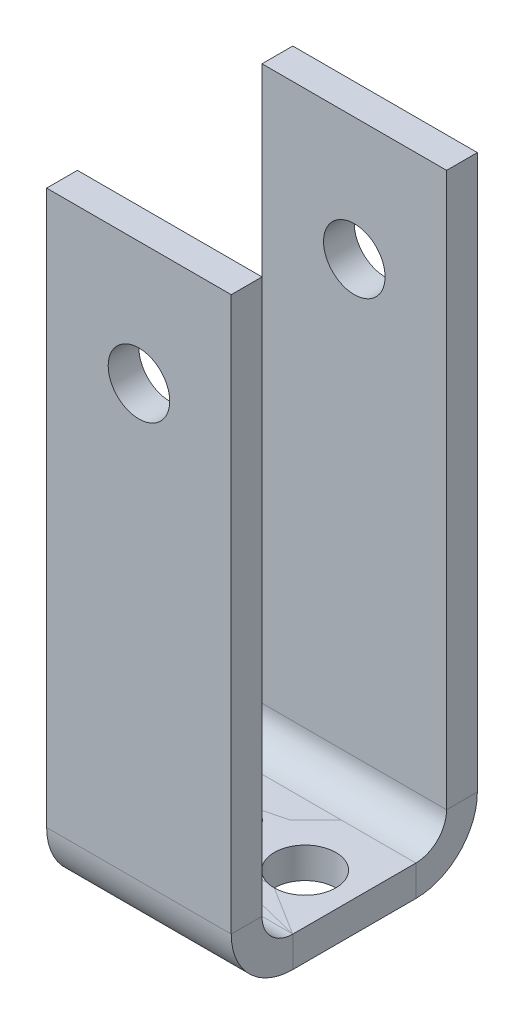
ISO-10303-21;
HEADER;
FILE_DESCRIPTION(('STEP AP214'),'2;1');
FILE_NAME('part.step','',(''),(''),'','','');
FILE_SCHEMA(('AUTOMOTIVE_DESIGN { 1 0 10303 214 1 1 1 1 }'));
ENDSEC;
DATA;
#1=APPLICATION_CONTEXT('core data for automotive mechanical design processes');
#2=APPLICATION_PROTOCOL_DEFINITION('international standard','automotive_design',2000,#1);
#3=PRODUCT_CONTEXT('',#1,'mechanical');
#4=PRODUCT('Part','Part','',(#3));
#5=PRODUCT_RELATED_PRODUCT_CATEGORY('part','',(#4));
#6=PRODUCT_DEFINITION_FORMATION('','',#4);
#7=PRODUCT_DEFINITION_CONTEXT('part definition',#1,'design');
#8=PRODUCT_DEFINITION('design','',#6,#7);
#9=PRODUCT_DEFINITION_SHAPE('','',#8);
#10=(LENGTH_UNIT() NAMED_UNIT(*) SI_UNIT(.MILLI.,.METRE.));
#11=(NAMED_UNIT(*) PLANE_ANGLE_UNIT() SI_UNIT($,.RADIAN.));
#12=(NAMED_UNIT(*) SI_UNIT($,.STERADIAN.) SOLID_ANGLE_UNIT());
#13=UNCERTAINTY_MEASURE_WITH_UNIT(LENGTH_MEASURE(1.E-05),#10,'distance_accuracy_value','');
#14=(GEOMETRIC_REPRESENTATION_CONTEXT(3) GLOBAL_UNCERTAINTY_ASSIGNED_CONTEXT((#13)) GLOBAL_UNIT_ASSIGNED_CONTEXT((#10,
#11,#12)) REPRESENTATION_CONTEXT('',''));
#15=CARTESIAN_POINT('',(0.,0.,0.));
#16=DIRECTION('',(0.,0.,1.));
#17=DIRECTION('',(1.,0.,0.));
#18=AXIS2_PLACEMENT_3D('',#15,#16,#17);
#19=CARTESIAN_POINT('',(19.05,3.175,0.));
#20=DIRECTION('',(-1.,0.,0.));
#21=DIRECTION('',(0.,0.,-1.));
#22=AXIS2_PLACEMENT_3D('',#19,#20,#21);
#23=PLANE('',#22);
#24=DIRECTION('',(0.,1.,0.));
#25=VECTOR('',#24,1.);
#26=CARTESIAN_POINT('',(19.05,3.175,0.));
#27=LINE('',#26,#25);
#28=CARTESIAN_POINT('',(19.05,0.,0.));
#29=VERTEX_POINT('',#28);
#30=CARTESIAN_POINT('',(19.05,3.175,0.));
#31=VERTEX_POINT('',#30);
#32=EDGE_CURVE('E14',#29,#31,#27,.T.);
#33=ORIENTED_EDGE('',*,*,#32,.F.);
#34=DIRECTION('',(0.,0.,-1.));
#35=VECTOR('',#34,1.);
#36=CARTESIAN_POINT('',(19.05,0.,0.));
#37=LINE('',#36,#35);
#38=CARTESIAN_POINT('',(19.05,0.,-12.7));
#39=VERTEX_POINT('',#38);
#40=EDGE_CURVE('E385',#29,#39,#37,.T.);
#41=ORIENTED_EDGE('',*,*,#40,.T.);
#42=DIRECTION('',(0.,1.,0.));
#43=VECTOR('',#42,1.);
#44=CARTESIAN_POINT('',(19.05,3.175,-12.7));
#45=LINE('',#44,#43);
#46=CARTESIAN_POINT('',(19.05,3.175,-12.7));
#47=VERTEX_POINT('',#46);
#48=EDGE_CURVE('E130',#39,#47,#45,.T.);
#49=ORIENTED_EDGE('',*,*,#48,.T.);
#50=DIRECTION('',(0.,0.,-1.));
#51=VECTOR('',#50,1.);
#52=CARTESIAN_POINT('',(19.05,3.175,0.));
#53=LINE('',#52,#51);
#54=EDGE_CURVE('E376',#31,#47,#53,.T.);
#55=ORIENTED_EDGE('',*,*,#54,.F.);
#56=EDGE_LOOP('',(#33,#41,#49,#55));
#57=FACE_BOUND('',#56,.T.);
#58=ADVANCED_FACE('F121',(#57),#23,.F.);
#59=CARTESIAN_POINT('',(0.,3.175,0.));
#60=DIRECTION('',(0.,-1.,0.));
#61=DIRECTION('',(0.,0.,-1.));
#62=AXIS2_PLACEMENT_3D('',#59,#60,#61);
#63=PLANE('',#62);
#64=CARTESIAN_POINT('',(5.08,3.175,-6.35));
#65=DIRECTION('',(0.,1.,0.));
#66=DIRECTION('',(0.,0.,1.));
#67=AXIS2_PLACEMENT_3D('',#64,#65,#66);
#68=CIRCLE('',#67,3.175);
#69=CARTESIAN_POINT('',(5.08,3.175,-3.175));
#70=VERTEX_POINT('',#69);
#71=EDGE_CURVE('E411',#70,#70,#68,.T.);
#72=ORIENTED_EDGE('',*,*,#71,.F.);
#73=EDGE_LOOP('',(#72));
#74=FACE_BOUND('',#73,.T.);
#75=CARTESIAN_POINT('',(13.97,3.175,-6.35));
#76=DIRECTION('',(0.,1.,0.));
#77=DIRECTION('',(0.,0.,1.));
#78=AXIS2_PLACEMENT_3D('',#75,#76,#77);
#79=CIRCLE('',#78,3.175);
#80=CARTESIAN_POINT('',(13.97,3.175,-3.175));
#81=VERTEX_POINT('',#80);
#82=EDGE_CURVE('E401',#81,#81,#79,.T.);
#83=ORIENTED_EDGE('',*,*,#82,.F.);
#84=EDGE_LOOP('',(#83));
#85=FACE_BOUND('',#84,.T.);
#86=DIRECTION('',(0.,0.,1.));
#87=VECTOR('',#86,1.);
#88=CARTESIAN_POINT('',(0.,3.175,0.));
#89=LINE('',#88,#87);
#90=CARTESIAN_POINT('',(0.,3.175,-12.7));
#91=VERTEX_POINT('',#90);
#92=CARTESIAN_POINT('',(0.,3.175,0.));
#93=VERTEX_POINT('',#92);
#94=EDGE_CURVE('E371',#91,#93,#89,.T.);
#95=ORIENTED_EDGE('',*,*,#94,.T.);
#96=DIRECTION('',(1.,0.,0.));
#97=VECTOR('',#96,1.);
#98=CARTESIAN_POINT('',(0.,3.175,0.));
#99=LINE('',#98,#97);
#100=EDGE_CURVE('E373',#93,#31,#99,.T.);
#101=ORIENTED_EDGE('',*,*,#100,.T.);
#102=ORIENTED_EDGE('',*,*,#54,.T.);
#103=DIRECTION('',(-1.,0.,0.));
#104=VECTOR('',#103,1.);
#105=CARTESIAN_POINT('',(0.,3.175,-12.7));
#106=LINE('',#105,#104);
#107=EDGE_CURVE('E138',#47,#91,#106,.T.);
#108=ORIENTED_EDGE('',*,*,#107,.T.);
#109=EDGE_LOOP('',(#95,#101,#102,#108));
#110=FACE_BOUND('',#109,.T.);
#111=ADVANCED_FACE('F445',(#74,#85,#110),#63,.F.);
#112=CARTESIAN_POINT('',(0.,0.,0.));
#113=DIRECTION('',(0.,-1.,0.));
#114=DIRECTION('',(0.,0.,-1.));
#115=AXIS2_PLACEMENT_3D('',#112,#113,#114);
#116=PLANE('',#115);
#117=CARTESIAN_POINT('',(5.08,0.,-6.35));
#118=DIRECTION('',(0.,-1.,0.));
#119=DIRECTION('',(0.,0.,-1.));
#120=AXIS2_PLACEMENT_3D('',#117,#118,#119);
#121=CIRCLE('',#120,3.175);
#122=CARTESIAN_POINT('',(5.08,0.,-9.525));
#123=VERTEX_POINT('',#122);
#124=EDGE_CURVE('E124',#123,#123,#121,.T.);
#125=ORIENTED_EDGE('',*,*,#124,.F.);
#126=EDGE_LOOP('',(#125));
#127=FACE_BOUND('',#126,.T.);
#128=CARTESIAN_POINT('',(13.97,0.,-6.35));
#129=DIRECTION('',(0.,-1.,0.));
#130=DIRECTION('',(0.,0.,-1.));
#131=AXIS2_PLACEMENT_3D('',#128,#129,#130);
#132=CIRCLE('',#131,3.175);
#133=CARTESIAN_POINT('',(13.97,0.,-9.525));
#134=VERTEX_POINT('',#133);
#135=EDGE_CURVE('E399',#134,#134,#132,.T.);
#136=ORIENTED_EDGE('',*,*,#135,.F.);
#137=EDGE_LOOP('',(#136));
#138=FACE_BOUND('',#137,.T.);
#139=DIRECTION('',(0.,0.,-1.));
#140=VECTOR('',#139,1.);
#141=CARTESIAN_POINT('',(0.,0.,0.));
#142=LINE('',#141,#140);
#143=CARTESIAN_POINT('',(0.,0.,-12.7));
#144=VERTEX_POINT('',#143);
#145=CARTESIAN_POINT('',(0.,0.,0.));
#146=VERTEX_POINT('',#145);
#147=EDGE_CURVE('E362',#144,#146,#142,.F.);
#148=ORIENTED_EDGE('',*,*,#147,.F.);
#149=DIRECTION('',(1.,0.,0.));
#150=VECTOR('',#149,1.);
#151=CARTESIAN_POINT('',(0.,0.,-12.7));
#152=LINE('',#151,#150);
#153=EDGE_CURVE('E374',#39,#144,#152,.F.);
#154=ORIENTED_EDGE('',*,*,#153,.F.);
#155=ORIENTED_EDGE('',*,*,#40,.F.);
#156=DIRECTION('',(1.,0.,0.));
#157=VECTOR('',#156,1.);
#158=CARTESIAN_POINT('',(0.,0.,0.));
#159=LINE('',#158,#157);
#160=EDGE_CURVE('E382',#146,#29,#159,.T.);
#161=ORIENTED_EDGE('',*,*,#160,.F.);
#162=EDGE_LOOP('',(#148,#154,#155,#161));
#163=FACE_BOUND('',#162,.T.);
#164=ADVANCED_FACE('F451',(#127,#138,#163),#116,.T.);
#165=CARTESIAN_POINT('',(19.05,6.34999999999997,-12.7));
#166=DIRECTION('',(1.,0.,0.));
#167=DIRECTION('',(0.,1.,0.));
#168=AXIS2_PLACEMENT_3D('',#165,#166,#167);
#169=PLANE('',#168);
#170=DIRECTION('',(0.,0.,1.));
#171=VECTOR('',#170,1.);
#172=CARTESIAN_POINT('',(19.05,6.35000000000001,-19.05));
#173=LINE('',#172,#171);
#174=CARTESIAN_POINT('',(19.05,6.34999999999996,-15.875));
#175=VERTEX_POINT('',#174);
#176=CARTESIAN_POINT('',(19.05,6.34999999999995,-19.05));
#177=VERTEX_POINT('',#176);
#178=EDGE_CURVE('E320',#175,#177,#173,.F.);
#179=ORIENTED_EDGE('',*,*,#178,.F.);
#180=CARTESIAN_POINT('',(19.05,6.34999999999997,-12.7));
#181=DIRECTION('',(-1.,0.,0.));
#182=DIRECTION('',(0.,-1.,0.));
#183=AXIS2_PLACEMENT_3D('',#180,#181,#182);
#184=CIRCLE('',#183,3.175);
#185=EDGE_CURVE('E366',#47,#175,#184,.F.);
#186=ORIENTED_EDGE('',*,*,#185,.F.);
#187=ORIENTED_EDGE('',*,*,#48,.F.);
#188=CARTESIAN_POINT('',(19.05,6.34999999999997,-12.7));
#189=DIRECTION('',(-1.,0.,0.));
#190=DIRECTION('',(0.,-1.,0.));
#191=AXIS2_PLACEMENT_3D('',#188,#189,#190);
#192=CIRCLE('',#191,6.35);
#193=EDGE_CURVE('E359',#39,#177,#192,.F.);
#194=ORIENTED_EDGE('',*,*,#193,.T.);
#195=EDGE_LOOP('',(#179,#186,#187,#194));
#196=FACE_BOUND('',#195,.T.);
#197=ADVANCED_FACE('F547',(#196),#169,.T.);
#198=CARTESIAN_POINT('',(0.,6.34999999999997,-12.7));
#199=DIRECTION('',(1.,0.,0.));
#200=DIRECTION('',(0.,1.,0.));
#201=AXIS2_PLACEMENT_3D('',#198,#199,#200);
#202=PLANE('',#201);
#203=CARTESIAN_POINT('',(0.,6.34999999999997,-12.7));
#204=DIRECTION('',(-1.,0.,0.));
#205=DIRECTION('',(0.,-1.,0.));
#206=AXIS2_PLACEMENT_3D('',#203,#204,#205);
#207=CIRCLE('',#206,3.175);
#208=CARTESIAN_POINT('',(0.,6.34999999999995,-15.875));
#209=VERTEX_POINT('',#208);
#210=EDGE_CURVE('E332',#209,#91,#207,.T.);
#211=ORIENTED_EDGE('',*,*,#210,.F.);
#212=DIRECTION('',(0.,0.,1.));
#213=VECTOR('',#212,1.);
#214=CARTESIAN_POINT('',(0.,6.34999999999999,-15.875));
#215=LINE('',#214,#213);
#216=CARTESIAN_POINT('',(0.,6.35000000000001,-19.05));
#217=VERTEX_POINT('',#216);
#218=EDGE_CURVE('E352',#209,#217,#215,.F.);
#219=ORIENTED_EDGE('',*,*,#218,.T.);
#220=CARTESIAN_POINT('',(0.,6.34999999999997,-12.7));
#221=DIRECTION('',(-1.,0.,0.));
#222=DIRECTION('',(0.,-1.,0.));
#223=AXIS2_PLACEMENT_3D('',#220,#221,#222);
#224=CIRCLE('',#223,6.35);
#225=EDGE_CURVE('E363',#217,#144,#224,.T.);
#226=ORIENTED_EDGE('',*,*,#225,.T.);
#227=DIRECTION('',(0.,1.,0.));
#228=VECTOR('',#227,1.);
#229=CARTESIAN_POINT('',(0.,3.175,-12.7));
#230=LINE('',#229,#228);
#231=EDGE_CURVE('E390',#144,#91,#230,.T.);
#232=ORIENTED_EDGE('',*,*,#231,.T.);
#233=EDGE_LOOP('',(#211,#219,#226,#232));
#234=FACE_BOUND('',#233,.T.);
#235=ADVANCED_FACE('F542',(#234),#202,.F.);
#236=CARTESIAN_POINT('',(0.,6.34999999999997,-12.7));
#237=DIRECTION('',(-1.,0.,0.));
#238=DIRECTION('',(0.,0.,-1.));
#239=AXIS2_PLACEMENT_3D('',#236,#237,#238);
#240=CYLINDRICAL_SURFACE('',#239,6.35);
#241=ORIENTED_EDGE('',*,*,#153,.T.);
#242=ORIENTED_EDGE('',*,*,#225,.F.);
#243=DIRECTION('',(-1.,0.,0.));
#244=VECTOR('',#243,1.);
#245=CARTESIAN_POINT('',(19.05,6.35000000000001,-19.05));
#246=LINE('',#245,#244);
#247=EDGE_CURVE('E350',#217,#177,#246,.F.);
#248=ORIENTED_EDGE('',*,*,#247,.T.);
#249=ORIENTED_EDGE('',*,*,#193,.F.);
#250=EDGE_LOOP('',(#241,#242,#248,#249));
#251=FACE_BOUND('',#250,.T.);
#252=ADVANCED_FACE('F539',(#251),#240,.T.);
#253=CARTESIAN_POINT('',(0.,6.34999999999997,-12.7));
#254=DIRECTION('',(-1.,0.,0.));
#255=DIRECTION('',(0.,0.,-1.));
#256=AXIS2_PLACEMENT_3D('',#253,#254,#255);
#257=CYLINDRICAL_SURFACE('',#256,3.175);
#258=ORIENTED_EDGE('',*,*,#107,.F.);
#259=ORIENTED_EDGE('',*,*,#185,.T.);
#260=DIRECTION('',(-1.,0.,0.));
#261=VECTOR('',#260,1.);
#262=CARTESIAN_POINT('',(19.05,6.34999999999999,-15.875));
#263=LINE('',#262,#261);
#264=EDGE_CURVE('E355',#175,#209,#263,.T.);
#265=ORIENTED_EDGE('',*,*,#264,.T.);
#266=ORIENTED_EDGE('',*,*,#210,.T.);
#267=EDGE_LOOP('',(#258,#259,#265,#266));
#268=FACE_BOUND('',#267,.T.);
#269=ADVANCED_FACE('F537',(#268),#257,.F.);
#270=CARTESIAN_POINT('',(19.05,3.17499999999999,-19.05));
#271=DIRECTION('',(-1.,0.,0.));
#272=DIRECTION('',(0.,0.,1.));
#273=AXIS2_PLACEMENT_3D('',#270,#271,#272);
#274=PLANE('',#273);
#275=ORIENTED_EDGE('',*,*,#178,.T.);
#276=DIRECTION('',(0.,-1.,0.));
#277=VECTOR('',#276,1.);
#278=CARTESIAN_POINT('',(19.05,0.,-19.05));
#279=LINE('',#278,#277);
#280=CARTESIAN_POINT('',(19.05,63.5,-19.0500000000002));
#281=VERTEX_POINT('',#280);
#282=EDGE_CURVE('E340',#281,#177,#279,.T.);
#283=ORIENTED_EDGE('',*,*,#282,.F.);
#284=DIRECTION('',(0.,0.,1.));
#285=VECTOR('',#284,1.);
#286=CARTESIAN_POINT('',(19.05,63.5,-19.0500000000002));
#287=LINE('',#286,#285);
#288=CARTESIAN_POINT('',(19.05,63.5,-15.8750000000002));
#289=VERTEX_POINT('',#288);
#290=EDGE_CURVE('E333',#281,#289,#287,.T.);
#291=ORIENTED_EDGE('',*,*,#290,.T.);
#292=DIRECTION('',(0.,1.,0.));
#293=VECTOR('',#292,1.);
#294=CARTESIAN_POINT('',(19.05,3.175,-15.875));
#295=LINE('',#294,#293);
#296=EDGE_CURVE('E347',#289,#175,#295,.F.);
#297=ORIENTED_EDGE('',*,*,#296,.T.);
#298=EDGE_LOOP('',(#275,#283,#291,#297));
#299=FACE_BOUND('',#298,.T.);
#300=ADVANCED_FACE('F533',(#299),#274,.F.);
#301=CARTESIAN_POINT('',(0.,63.5,-19.0500000000002));
#302=DIRECTION('',(1.,0.,0.));
#303=DIRECTION('',(0.,0.,-1.));
#304=AXIS2_PLACEMENT_3D('',#301,#302,#303);
#305=PLANE('',#304);
#306=ORIENTED_EDGE('',*,*,#218,.F.);
#307=DIRECTION('',(0.,-1.,0.));
#308=VECTOR('',#307,1.);
#309=CARTESIAN_POINT('',(0.,63.5,-15.8750000000002));
#310=LINE('',#309,#308);
#311=CARTESIAN_POINT('',(0.,63.5,-15.8750000000002));
#312=VERTEX_POINT('',#311);
#313=EDGE_CURVE('E345',#209,#312,#310,.F.);
#314=ORIENTED_EDGE('',*,*,#313,.T.);
#315=DIRECTION('',(0.,0.,1.));
#316=VECTOR('',#315,1.);
#317=CARTESIAN_POINT('',(0.,63.5,-19.0500000000002));
#318=LINE('',#317,#316);
#319=CARTESIAN_POINT('',(0.,63.5,-19.0500000000002));
#320=VERTEX_POINT('',#319);
#321=EDGE_CURVE('E329',#320,#312,#318,.T.);
#322=ORIENTED_EDGE('',*,*,#321,.F.);
#323=DIRECTION('',(0.,1.,0.));
#324=VECTOR('',#323,1.);
#325=CARTESIAN_POINT('',(0.,0.,-19.05));
#326=LINE('',#325,#324);
#327=EDGE_CURVE('E338',#217,#320,#326,.T.);
#328=ORIENTED_EDGE('',*,*,#327,.F.);
#329=EDGE_LOOP('',(#306,#314,#322,#328));
#330=FACE_BOUND('',#329,.T.);
#331=ADVANCED_FACE('F523',(#330),#305,.F.);
#332=CARTESIAN_POINT('',(0.,0.,-19.05));
#333=DIRECTION('',(0.,0.,1.));
#334=DIRECTION('',(0.,-1.,0.));
#335=AXIS2_PLACEMENT_3D('',#332,#333,#334);
#336=PLANE('',#335);
#337=CARTESIAN_POINT('',(9.525,50.8,-19.0500000000002));
#338=DIRECTION('',(0.,0.,1.));
#339=DIRECTION('',(1.,0.,0.));
#340=AXIS2_PLACEMENT_3D('',#337,#338,#339);
#341=CIRCLE('',#340,3.175);
#342=CARTESIAN_POINT('',(12.7,50.8,-19.0500000000002));
#343=VERTEX_POINT('',#342);
#344=EDGE_CURVE('E398',#343,#343,#341,.T.);
#345=ORIENTED_EDGE('',*,*,#344,.T.);
#346=EDGE_LOOP('',(#345));
#347=FACE_BOUND('',#346,.T.);
#348=ORIENTED_EDGE('',*,*,#247,.F.);
#349=ORIENTED_EDGE('',*,*,#327,.T.);
#350=DIRECTION('',(1.,0.,0.));
#351=VECTOR('',#350,1.);
#352=CARTESIAN_POINT('',(0.,63.5,-19.0500000000002));
#353=LINE('',#352,#351);
#354=EDGE_CURVE('E336',#320,#281,#353,.T.);
#355=ORIENTED_EDGE('',*,*,#354,.T.);
#356=ORIENTED_EDGE('',*,*,#282,.T.);
#357=EDGE_LOOP('',(#348,#349,#355,#356));
#358=FACE_BOUND('',#357,.T.);
#359=ADVANCED_FACE('F519',(#347,#358),#336,.F.);
#360=CARTESIAN_POINT('',(0.,0.,-15.875));
#361=DIRECTION('',(0.,0.,1.));
#362=DIRECTION('',(0.,-1.,0.));
#363=AXIS2_PLACEMENT_3D('',#360,#361,#362);
#364=PLANE('',#363);
#365=CARTESIAN_POINT('',(9.525,50.8,-15.8750000000002));
#366=DIRECTION('',(0.,0.,1.));
#367=DIRECTION('',(0.,-1.,0.));
#368=AXIS2_PLACEMENT_3D('',#365,#366,#367);
#369=CIRCLE('',#368,3.175);
#370=CARTESIAN_POINT('',(9.525,47.625,-15.8750000000001));
#371=VERTEX_POINT('',#370);
#372=EDGE_CURVE('E273',#371,#371,#369,.T.);
#373=ORIENTED_EDGE('',*,*,#372,.F.);
#374=EDGE_LOOP('',(#373));
#375=FACE_BOUND('',#374,.T.);
#376=ORIENTED_EDGE('',*,*,#313,.F.);
#377=ORIENTED_EDGE('',*,*,#264,.F.);
#378=ORIENTED_EDGE('',*,*,#296,.F.);
#379=DIRECTION('',(-1.,0.,0.));
#380=VECTOR('',#379,1.);
#381=CARTESIAN_POINT('',(19.05,63.5,-15.8750000000002));
#382=LINE('',#381,#380);
#383=EDGE_CURVE('E343',#312,#289,#382,.F.);
#384=ORIENTED_EDGE('',*,*,#383,.F.);
#385=EDGE_LOOP('',(#376,#377,#378,#384));
#386=FACE_BOUND('',#385,.T.);
#387=ADVANCED_FACE('F522',(#375,#386),#364,.T.);
#388=CARTESIAN_POINT('',(19.05,63.5,-19.0500000000002));
#389=DIRECTION('',(0.,-1.,0.));
#390=DIRECTION('',(0.,0.,-1.));
#391=AXIS2_PLACEMENT_3D('',#388,#389,#390);
#392=PLANE('',#391);
#393=ORIENTED_EDGE('',*,*,#383,.T.);
#394=ORIENTED_EDGE('',*,*,#290,.F.);
#395=ORIENTED_EDGE('',*,*,#354,.F.);
#396=ORIENTED_EDGE('',*,*,#321,.T.);
#397=EDGE_LOOP('',(#393,#394,#395,#396));
#398=FACE_BOUND('',#397,.T.);
#399=ADVANCED_FACE('F516',(#398),#392,.F.);
#400=CARTESIAN_POINT('',(0.,6.34999999999999,0.));
#401=DIRECTION('',(-1.,0.,0.));
#402=DIRECTION('',(0.,0.,1.));
#403=AXIS2_PLACEMENT_3D('',#400,#401,#402);
#404=PLANE('',#403);
#405=DIRECTION('',(0.,0.,-1.));
#406=VECTOR('',#405,1.);
#407=CARTESIAN_POINT('',(0.,6.34999999999999,6.34999999999999));
#408=LINE('',#407,#406);
#409=CARTESIAN_POINT('',(0.,6.34999999999999,3.17499999999999));
#410=VERTEX_POINT('',#409);
#411=CARTESIAN_POINT('',(0.,6.34999999999999,6.34999999999999));
#412=VERTEX_POINT('',#411);
#413=EDGE_CURVE('E277',#410,#412,#408,.F.);
#414=ORIENTED_EDGE('',*,*,#413,.F.);
#415=CARTESIAN_POINT('',(0.,6.34999999999999,0.));
#416=DIRECTION('',(1.,0.,0.));
#417=DIRECTION('',(0.,0.,-1.));
#418=AXIS2_PLACEMENT_3D('',#415,#416,#417);
#419=CIRCLE('',#418,3.17499999999999);
#420=EDGE_CURVE('E324',#93,#410,#419,.F.);
#421=ORIENTED_EDGE('',*,*,#420,.F.);
#422=DIRECTION('',(0.,1.,0.));
#423=VECTOR('',#422,1.);
#424=CARTESIAN_POINT('',(0.,3.175,0.));
#425=LINE('',#424,#423);
#426=EDGE_CURVE('E379',#146,#93,#425,.T.);
#427=ORIENTED_EDGE('',*,*,#426,.F.);
#428=CARTESIAN_POINT('',(0.,6.34999999999999,0.));
#429=DIRECTION('',(1.,0.,0.));
#430=DIRECTION('',(0.,0.,-1.));
#431=AXIS2_PLACEMENT_3D('',#428,#429,#430);
#432=CIRCLE('',#431,6.34999999999999);
#433=EDGE_CURVE('E317',#146,#412,#432,.F.);
#434=ORIENTED_EDGE('',*,*,#433,.T.);
#435=EDGE_LOOP('',(#414,#421,#427,#434));
#436=FACE_BOUND('',#435,.T.);
#437=ADVANCED_FACE('F484',(#436),#404,.T.);
#438=CARTESIAN_POINT('',(19.05,6.34999999999999,0.));
#439=DIRECTION('',(-1.,0.,0.));
#440=DIRECTION('',(0.,0.,1.));
#441=AXIS2_PLACEMENT_3D('',#438,#439,#440);
#442=PLANE('',#441);
#443=CARTESIAN_POINT('',(19.05,6.34999999999999,0.));
#444=DIRECTION('',(1.,0.,0.));
#445=DIRECTION('',(0.,0.,-1.));
#446=AXIS2_PLACEMENT_3D('',#443,#444,#445);
#447=CIRCLE('',#446,3.17499999999999);
#448=CARTESIAN_POINT('',(19.05,6.34999999999999,3.17499999999999));
#449=VERTEX_POINT('',#448);
#450=EDGE_CURVE('E290',#449,#31,#447,.T.);
#451=ORIENTED_EDGE('',*,*,#450,.F.);
#452=DIRECTION('',(0.,0.,-1.));
#453=VECTOR('',#452,1.);
#454=CARTESIAN_POINT('',(19.05,6.34999999999999,3.175));
#455=LINE('',#454,#453);
#456=CARTESIAN_POINT('',(19.05,6.34999999999999,6.34999999999999));
#457=VERTEX_POINT('',#456);
#458=EDGE_CURVE('E310',#449,#457,#455,.F.);
#459=ORIENTED_EDGE('',*,*,#458,.T.);
#460=CARTESIAN_POINT('',(19.05,6.34999999999999,0.));
#461=DIRECTION('',(1.,0.,0.));
#462=DIRECTION('',(0.,0.,-1.));
#463=AXIS2_PLACEMENT_3D('',#460,#461,#462);
#464=CIRCLE('',#463,6.34999999999999);
#465=EDGE_CURVE('E321',#457,#29,#464,.T.);
#466=ORIENTED_EDGE('',*,*,#465,.T.);
#467=ORIENTED_EDGE('',*,*,#32,.T.);
#468=EDGE_LOOP('',(#451,#459,#466,#467));
#469=FACE_BOUND('',#468,.T.);
#470=ADVANCED_FACE('F463',(#469),#442,.F.);
#471=CARTESIAN_POINT('',(19.05,6.34999999999999,0.));
#472=DIRECTION('',(1.,0.,0.));
#473=DIRECTION('',(0.,0.,1.));
#474=AXIS2_PLACEMENT_3D('',#471,#472,#473);
#475=CYLINDRICAL_SURFACE('',#474,6.34999999999999);
#476=ORIENTED_EDGE('',*,*,#160,.T.);
#477=ORIENTED_EDGE('',*,*,#465,.F.);
#478=DIRECTION('',(1.,0.,0.));
#479=VECTOR('',#478,1.);
#480=CARTESIAN_POINT('',(0.,6.34999999999999,6.34999999999999));
#481=LINE('',#480,#479);
#482=EDGE_CURVE('E308',#457,#412,#481,.F.);
#483=ORIENTED_EDGE('',*,*,#482,.T.);
#484=ORIENTED_EDGE('',*,*,#433,.F.);
#485=EDGE_LOOP('',(#476,#477,#483,#484));
#486=FACE_BOUND('',#485,.T.);
#487=ADVANCED_FACE('F461',(#486),#475,.T.);
#488=CARTESIAN_POINT('',(19.05,6.34999999999999,0.));
#489=DIRECTION('',(1.,0.,0.));
#490=DIRECTION('',(0.,0.,1.));
#491=AXIS2_PLACEMENT_3D('',#488,#489,#490);
#492=CYLINDRICAL_SURFACE('',#491,3.17499999999999);
#493=ORIENTED_EDGE('',*,*,#100,.F.);
#494=ORIENTED_EDGE('',*,*,#420,.T.);
#495=DIRECTION('',(1.,0.,0.));
#496=VECTOR('',#495,1.);
#497=CARTESIAN_POINT('',(0.,6.34999999999999,3.17499999999999));
#498=LINE('',#497,#496);
#499=EDGE_CURVE('E313',#410,#449,#498,.T.);
#500=ORIENTED_EDGE('',*,*,#499,.T.);
#501=ORIENTED_EDGE('',*,*,#450,.T.);
#502=EDGE_LOOP('',(#493,#494,#500,#501));
#503=FACE_BOUND('',#502,.T.);
#504=ADVANCED_FACE('F488',(#503),#492,.F.);
#505=CARTESIAN_POINT('',(0.,3.175,6.34999999999999));
#506=DIRECTION('',(1.,0.,0.));
#507=DIRECTION('',(0.,0.,-1.));
#508=AXIS2_PLACEMENT_3D('',#505,#506,#507);
#509=PLANE('',#508);
#510=ORIENTED_EDGE('',*,*,#413,.T.);
#511=DIRECTION('',(0.,-1.,0.));
#512=VECTOR('',#511,1.);
#513=CARTESIAN_POINT('',(0.,0.,6.34999999999999));
#514=LINE('',#513,#512);
#515=CARTESIAN_POINT('',(0.,63.5,6.34999999999999));
#516=VERTEX_POINT('',#515);
#517=EDGE_CURVE('E298',#516,#412,#514,.T.);
#518=ORIENTED_EDGE('',*,*,#517,.F.);
#519=DIRECTION('',(0.,0.,-1.));
#520=VECTOR('',#519,1.);
#521=CARTESIAN_POINT('',(0.,63.5,6.34999999999999));
#522=LINE('',#521,#520);
#523=CARTESIAN_POINT('',(0.,63.5,3.17499999999999));
#524=VERTEX_POINT('',#523);
#525=EDGE_CURVE('E291',#516,#524,#522,.T.);
#526=ORIENTED_EDGE('',*,*,#525,.T.);
#527=DIRECTION('',(0.,1.,0.));
#528=VECTOR('',#527,1.);
#529=CARTESIAN_POINT('',(0.,3.175,3.17499999999999));
#530=LINE('',#529,#528);
#531=EDGE_CURVE('E305',#524,#410,#530,.F.);
#532=ORIENTED_EDGE('',*,*,#531,.T.);
#533=EDGE_LOOP('',(#510,#518,#526,#532));
#534=FACE_BOUND('',#533,.T.);
#535=ADVANCED_FACE('F481',(#534),#509,.F.);
#536=CARTESIAN_POINT('',(19.05,63.5,6.34999999999999));
#537=DIRECTION('',(-1.,0.,0.));
#538=DIRECTION('',(0.,0.,1.));
#539=AXIS2_PLACEMENT_3D('',#536,#537,#538);
#540=PLANE('',#539);
#541=ORIENTED_EDGE('',*,*,#458,.F.);
#542=DIRECTION('',(0.,-1.,0.));
#543=VECTOR('',#542,1.);
#544=CARTESIAN_POINT('',(19.05,63.5,3.17499999999999));
#545=LINE('',#544,#543);
#546=CARTESIAN_POINT('',(19.05,63.5,3.17499999999999));
#547=VERTEX_POINT('',#546);
#548=EDGE_CURVE('E303',#449,#547,#545,.F.);
#549=ORIENTED_EDGE('',*,*,#548,.T.);
#550=DIRECTION('',(0.,0.,-1.));
#551=VECTOR('',#550,1.);
#552=CARTESIAN_POINT('',(19.05,63.5,6.34999999999999));
#553=LINE('',#552,#551);
#554=CARTESIAN_POINT('',(19.05,63.5,6.34999999999999));
#555=VERTEX_POINT('',#554);
#556=EDGE_CURVE('E287',#555,#547,#553,.T.);
#557=ORIENTED_EDGE('',*,*,#556,.F.);
#558=DIRECTION('',(0.,1.,0.));
#559=VECTOR('',#558,1.);
#560=CARTESIAN_POINT('',(19.05,0.,6.34999999999999));
#561=LINE('',#560,#559);
#562=EDGE_CURVE('E296',#457,#555,#561,.T.);
#563=ORIENTED_EDGE('',*,*,#562,.F.);
#564=EDGE_LOOP('',(#541,#549,#557,#563));
#565=FACE_BOUND('',#564,.T.);
#566=ADVANCED_FACE('F473',(#565),#540,.F.);
#567=CARTESIAN_POINT('',(0.,0.,6.34999999999999));
#568=DIRECTION('',(0.,0.,-1.));
#569=DIRECTION('',(-1.,0.,0.));
#570=AXIS2_PLACEMENT_3D('',#567,#568,#569);
#571=PLANE('',#570);
#572=CARTESIAN_POINT('',(9.525,50.8,6.34999999999999));
#573=DIRECTION('',(0.,0.,-1.));
#574=DIRECTION('',(-1.,0.,0.));
#575=AXIS2_PLACEMENT_3D('',#572,#573,#574);
#576=CIRCLE('',#575,3.175);
#577=CARTESIAN_POINT('',(6.35,50.8,6.34999999999999));
#578=VERTEX_POINT('',#577);
#579=EDGE_CURVE('E397',#578,#578,#576,.T.);
#580=ORIENTED_EDGE('',*,*,#579,.T.);
#581=EDGE_LOOP('',(#580));
#582=FACE_BOUND('',#581,.T.);
#583=ORIENTED_EDGE('',*,*,#482,.F.);
#584=ORIENTED_EDGE('',*,*,#562,.T.);
#585=DIRECTION('',(-1.,0.,0.));
#586=VECTOR('',#585,1.);
#587=CARTESIAN_POINT('',(0.,63.5,6.34999999999999));
#588=LINE('',#587,#586);
#589=EDGE_CURVE('E294',#555,#516,#588,.T.);
#590=ORIENTED_EDGE('',*,*,#589,.T.);
#591=ORIENTED_EDGE('',*,*,#517,.T.);
#592=EDGE_LOOP('',(#583,#584,#590,#591));
#593=FACE_BOUND('',#592,.T.);
#594=ADVANCED_FACE('F470',(#582,#593),#571,.F.);
#595=CARTESIAN_POINT('',(0.,0.,3.17499999999999));
#596=DIRECTION('',(0.,0.,-1.));
#597=DIRECTION('',(-1.,0.,0.));
#598=AXIS2_PLACEMENT_3D('',#595,#596,#597);
#599=PLANE('',#598);
#600=CARTESIAN_POINT('',(9.525,50.8,3.17499999999999));
#601=DIRECTION('',(0.,0.,-1.));
#602=DIRECTION('',(-1.,0.,0.));
#603=AXIS2_PLACEMENT_3D('',#600,#601,#602);
#604=CIRCLE('',#603,3.175);
#605=CARTESIAN_POINT('',(6.35,50.8,3.17499999999999));
#606=VERTEX_POINT('',#605);
#607=EDGE_CURVE('E395',#606,#606,#604,.T.);
#608=ORIENTED_EDGE('',*,*,#607,.F.);
#609=EDGE_LOOP('',(#608));
#610=FACE_BOUND('',#609,.T.);
#611=ORIENTED_EDGE('',*,*,#548,.F.);
#612=ORIENTED_EDGE('',*,*,#499,.F.);
#613=ORIENTED_EDGE('',*,*,#531,.F.);
#614=DIRECTION('',(1.,0.,0.));
#615=VECTOR('',#614,1.);
#616=CARTESIAN_POINT('',(0.,63.5,3.17499999999999));
#617=LINE('',#616,#615);
#618=EDGE_CURVE('E301',#547,#524,#617,.F.);
#619=ORIENTED_EDGE('',*,*,#618,.F.);
#620=EDGE_LOOP('',(#611,#612,#613,#619));
#621=FACE_BOUND('',#620,.T.);
#622=ADVANCED_FACE('F490',(#610,#621),#599,.T.);
#623=CARTESIAN_POINT('',(0.,63.5,6.34999999999999));
#624=DIRECTION('',(0.,-1.,0.));
#625=DIRECTION('',(0.,0.,-1.));
#626=AXIS2_PLACEMENT_3D('',#623,#624,#625);
#627=PLANE('',#626);
#628=ORIENTED_EDGE('',*,*,#618,.T.);
#629=ORIENTED_EDGE('',*,*,#525,.F.);
#630=ORIENTED_EDGE('',*,*,#589,.F.);
#631=ORIENTED_EDGE('',*,*,#556,.T.);
#632=EDGE_LOOP('',(#628,#629,#630,#631));
#633=FACE_BOUND('',#632,.T.);
#634=ADVANCED_FACE('F478',(#633),#627,.F.);
#635=CARTESIAN_POINT('',(0.,6.35,-12.7));
#636=DIRECTION('',(0.,0.,-1.));
#637=DIRECTION('',(-1.,0.,0.));
#638=AXIS2_PLACEMENT_3D('',#635,#636,#637);
#639=PLANE('',#638);
#640=DIRECTION('',(1.,0.,0.));
#641=VECTOR('',#640,1.);
#642=CARTESIAN_POINT('',(-6.35,6.34999999999998,-12.7));
#643=LINE('',#642,#641);
#644=CARTESIAN_POINT('',(-3.175,6.34999999999999,-12.7));
#645=VERTEX_POINT('',#644);
#646=CARTESIAN_POINT('',(-6.35,6.34999999999998,-12.7));
#647=VERTEX_POINT('',#646);
#648=EDGE_CURVE('E255',#645,#647,#643,.F.);
#649=ORIENTED_EDGE('',*,*,#648,.F.);
#650=CARTESIAN_POINT('',(0.,6.35,-12.7));
#651=DIRECTION('',(0.,0.,1.));
#652=DIRECTION('',(1.,0.,0.));
#653=AXIS2_PLACEMENT_3D('',#650,#651,#652);
#654=CIRCLE('',#653,3.175);
#655=EDGE_CURVE('E281',#91,#645,#654,.F.);
#656=ORIENTED_EDGE('',*,*,#655,.F.);
#657=ORIENTED_EDGE('',*,*,#231,.F.);
#658=CARTESIAN_POINT('',(0.,6.35,-12.7));
#659=DIRECTION('',(0.,0.,1.));
#660=DIRECTION('',(1.,0.,0.));
#661=AXIS2_PLACEMENT_3D('',#658,#659,#660);
#662=CIRCLE('',#661,6.35);
#663=EDGE_CURVE('E274',#144,#647,#662,.F.);
#664=ORIENTED_EDGE('',*,*,#663,.T.);
#665=EDGE_LOOP('',(#649,#656,#657,#664));
#666=FACE_BOUND('',#665,.T.);
#667=ADVANCED_FACE('F499',(#666),#639,.T.);
#668=CARTESIAN_POINT('',(0.,6.35,0.));
#669=DIRECTION('',(0.,0.,-1.));
#670=DIRECTION('',(-1.,0.,0.));
#671=AXIS2_PLACEMENT_3D('',#668,#669,#670);
#672=PLANE('',#671);
#673=CARTESIAN_POINT('',(0.,6.35,0.));
#674=DIRECTION('',(0.,0.,1.));
#675=DIRECTION('',(1.,0.,0.));
#676=AXIS2_PLACEMENT_3D('',#673,#674,#675);
#677=CIRCLE('',#676,3.175);
#678=CARTESIAN_POINT('',(-3.175,6.34999999999999,0.));
#679=VERTEX_POINT('',#678);
#680=EDGE_CURVE('E284',#679,#93,#677,.T.);
#681=ORIENTED_EDGE('',*,*,#680,.F.);
#682=DIRECTION('',(1.,0.,0.));
#683=VECTOR('',#682,1.);
#684=CARTESIAN_POINT('',(-3.175,6.34999999999999,0.));
#685=LINE('',#684,#683);
#686=CARTESIAN_POINT('',(-6.35,6.34999999999998,0.));
#687=VERTEX_POINT('',#686);
#688=EDGE_CURVE('E267',#679,#687,#685,.F.);
#689=ORIENTED_EDGE('',*,*,#688,.T.);
#690=CARTESIAN_POINT('',(0.,6.35,0.));
#691=DIRECTION('',(0.,0.,1.));
#692=DIRECTION('',(1.,0.,0.));
#693=AXIS2_PLACEMENT_3D('',#690,#691,#692);
#694=CIRCLE('',#693,6.35);
#695=EDGE_CURVE('E278',#687,#146,#694,.T.);
#696=ORIENTED_EDGE('',*,*,#695,.T.);
#697=ORIENTED_EDGE('',*,*,#426,.T.);
#698=EDGE_LOOP('',(#681,#689,#696,#697));
#699=FACE_BOUND('',#698,.T.);
#700=ADVANCED_FACE('F430',(#699),#672,.F.);
#701=CARTESIAN_POINT('',(0.,6.35,0.));
#702=DIRECTION('',(0.,0.,1.));
#703=DIRECTION('',(-1.,0.,0.));
#704=AXIS2_PLACEMENT_3D('',#701,#702,#703);
#705=CYLINDRICAL_SURFACE('',#704,6.35);
#706=ORIENTED_EDGE('',*,*,#147,.T.);
#707=ORIENTED_EDGE('',*,*,#695,.F.);
#708=DIRECTION('',(0.,0.,1.));
#709=VECTOR('',#708,1.);
#710=CARTESIAN_POINT('',(-6.35,6.34999999999998,-12.7));
#711=LINE('',#710,#709);
#712=EDGE_CURVE('E265',#687,#647,#711,.F.);
#713=ORIENTED_EDGE('',*,*,#712,.T.);
#714=ORIENTED_EDGE('',*,*,#663,.F.);
#715=EDGE_LOOP('',(#706,#707,#713,#714));
#716=FACE_BOUND('',#715,.T.);
#717=ADVANCED_FACE('F440',(#716),#705,.T.);
#718=CARTESIAN_POINT('',(0.,6.35,0.));
#719=DIRECTION('',(0.,0.,1.));
#720=DIRECTION('',(-1.,0.,0.));
#721=AXIS2_PLACEMENT_3D('',#718,#719,#720);
#722=CYLINDRICAL_SURFACE('',#721,3.175);
#723=ORIENTED_EDGE('',*,*,#94,.F.);
#724=ORIENTED_EDGE('',*,*,#655,.T.);
#725=DIRECTION('',(0.,0.,1.));
#726=VECTOR('',#725,1.);
#727=CARTESIAN_POINT('',(-3.175,6.34999999999999,-12.7));
#728=LINE('',#727,#726);
#729=EDGE_CURVE('E270',#645,#679,#728,.T.);
#730=ORIENTED_EDGE('',*,*,#729,.T.);
#731=ORIENTED_EDGE('',*,*,#680,.T.);
#732=EDGE_LOOP('',(#723,#724,#730,#731));
#733=FACE_BOUND('',#732,.T.);
#734=ADVANCED_FACE('F426',(#733),#722,.F.);
#735=CARTESIAN_POINT('',(-6.35000000000009,31.75,0.));
#736=DIRECTION('',(0.,0.,-1.));
#737=DIRECTION('',(-1.,0.,0.));
#738=AXIS2_PLACEMENT_3D('',#735,#736,#737);
#739=PLANE('',#738);
#740=ORIENTED_EDGE('',*,*,#688,.F.);
#741=DIRECTION('',(0.,-1.,0.));
#742=VECTOR('',#741,1.);
#743=CARTESIAN_POINT('',(-3.17500000000009,31.75,0.));
#744=LINE('',#743,#742);
#745=CARTESIAN_POINT('',(-3.17500000000009,31.75,0.));
#746=VERTEX_POINT('',#745);
#747=EDGE_CURVE('E263',#679,#746,#744,.F.);
#748=ORIENTED_EDGE('',*,*,#747,.T.);
#749=DIRECTION('',(1.,0.,0.));
#750=VECTOR('',#749,1.);
#751=CARTESIAN_POINT('',(-6.35000000000009,31.75,0.));
#752=LINE('',#751,#750);
#753=CARTESIAN_POINT('',(-6.35000000000009,31.75,0.));
#754=VERTEX_POINT('',#753);
#755=EDGE_CURVE('E251',#754,#746,#752,.T.);
#756=ORIENTED_EDGE('',*,*,#755,.F.);
#757=DIRECTION('',(0.,1.,0.));
#758=VECTOR('',#757,1.);
#759=CARTESIAN_POINT('',(-6.34999999999998,0.,0.));
#760=LINE('',#759,#758);
#761=EDGE_CURVE('E238',#687,#754,#760,.T.);
#762=ORIENTED_EDGE('',*,*,#761,.F.);
#763=EDGE_LOOP('',(#740,#748,#756,#762));
#764=FACE_BOUND('',#763,.T.);
#765=ADVANCED_FACE('F432',(#764),#739,.F.);
#766=CARTESIAN_POINT('',(-6.34999999999999,3.17499999999999,-12.7));
#767=DIRECTION('',(0.,0.,1.));
#768=DIRECTION('',(1.,0.,0.));
#769=AXIS2_PLACEMENT_3D('',#766,#767,#768);
#770=PLANE('',#769);
#771=ORIENTED_EDGE('',*,*,#648,.T.);
#772=DIRECTION('',(0.,-1.,0.));
#773=VECTOR('',#772,1.);
#774=CARTESIAN_POINT('',(-6.34999999999998,0.,-12.7));
#775=LINE('',#774,#773);
#776=CARTESIAN_POINT('',(-6.35000000000009,31.75,-12.7));
#777=VERTEX_POINT('',#776);
#778=EDGE_CURVE('E236',#777,#647,#775,.T.);
#779=ORIENTED_EDGE('',*,*,#778,.F.);
#780=DIRECTION('',(1.,0.,0.));
#781=VECTOR('',#780,1.);
#782=CARTESIAN_POINT('',(-6.35000000000009,31.75,-12.7));
#783=LINE('',#782,#781);
#784=CARTESIAN_POINT('',(-3.17500000000009,31.75,-12.7));
#785=VERTEX_POINT('',#784);
#786=EDGE_CURVE('E244',#777,#785,#783,.T.);
#787=ORIENTED_EDGE('',*,*,#786,.T.);
#788=DIRECTION('',(0.,1.,0.));
#789=VECTOR('',#788,1.);
#790=CARTESIAN_POINT('',(-3.17499999999999,3.175,-12.7));
#791=LINE('',#790,#789);
#792=EDGE_CURVE('E260',#785,#645,#791,.F.);
#793=ORIENTED_EDGE('',*,*,#792,.T.);
#794=EDGE_LOOP('',(#771,#779,#787,#793));
#795=FACE_BOUND('',#794,.T.);
#796=ADVANCED_FACE('F254',(#795),#770,.F.);
#797=CARTESIAN_POINT('',(-6.34999999999998,0.,0.));
#798=DIRECTION('',(1.,0.,0.));
#799=DIRECTION('',(0.,1.,0.));
#800=AXIS2_PLACEMENT_3D('',#797,#798,#799);
#801=PLANE('',#800);
#802=CARTESIAN_POINT('',(-6.35000000000001,10.16,-6.35));
#803=DIRECTION('',(1.,0.,0.));
#804=DIRECTION('',(0.,1.,0.));
#805=AXIS2_PLACEMENT_3D('',#802,#803,#804);
#806=CIRCLE('',#805,3.17499999999999);
#807=CARTESIAN_POINT('',(-6.35000000000002,13.335,-6.35));
#808=VERTEX_POINT('',#807);
#809=EDGE_CURVE('E707',#808,#808,#806,.T.);
#810=ORIENTED_EDGE('',*,*,#809,.T.);
#811=EDGE_LOOP('',(#810));
#812=FACE_BOUND('',#811,.T.);
#813=CARTESIAN_POINT('',(-6.35000000000004,19.05,-6.35));
#814=DIRECTION('',(1.,0.,0.));
#815=DIRECTION('',(0.,1.,0.));
#816=AXIS2_PLACEMENT_3D('',#813,#814,#815);
#817=CIRCLE('',#816,3.17499999999999);
#818=CARTESIAN_POINT('',(-6.35000000000005,22.225,-6.35));
#819=VERTEX_POINT('',#818);
#820=EDGE_CURVE('E711',#819,#819,#817,.T.);
#821=ORIENTED_EDGE('',*,*,#820,.T.);
#822=EDGE_LOOP('',(#821));
#823=FACE_BOUND('',#822,.T.);
#824=ORIENTED_EDGE('',*,*,#712,.F.);
#825=ORIENTED_EDGE('',*,*,#761,.T.);
#826=DIRECTION('',(0.,0.,-1.));
#827=VECTOR('',#826,1.);
#828=CARTESIAN_POINT('',(-6.35000000000009,31.75,0.));
#829=LINE('',#828,#827);
#830=EDGE_CURVE('E231',#754,#777,#829,.T.);
#831=ORIENTED_EDGE('',*,*,#830,.T.);
#832=ORIENTED_EDGE('',*,*,#778,.T.);
#833=EDGE_LOOP('',(#824,#825,#831,#832));
#834=FACE_BOUND('',#833,.T.);
#835=ADVANCED_FACE('F234',(#812,#823,#834),#801,.F.);
#836=CARTESIAN_POINT('',(-3.17499999999998,0.,0.));
#837=DIRECTION('',(1.,0.,0.));
#838=DIRECTION('',(0.,1.,0.));
#839=AXIS2_PLACEMENT_3D('',#836,#837,#838);
#840=PLANE('',#839);
#841=CARTESIAN_POINT('',(-3.17500000000001,10.16,-6.35));
#842=DIRECTION('',(1.,0.,0.));
#843=DIRECTION('',(0.,0.,-1.));
#844=AXIS2_PLACEMENT_3D('',#841,#842,#843);
#845=CIRCLE('',#844,3.17499999999999);
#846=CARTESIAN_POINT('',(-3.17500000000001,10.16,-9.52499999999999));
#847=VERTEX_POINT('',#846);
#848=EDGE_CURVE('E704',#847,#847,#845,.T.);
#849=ORIENTED_EDGE('',*,*,#848,.F.);
#850=EDGE_LOOP('',(#849));
#851=FACE_BOUND('',#850,.T.);
#852=CARTESIAN_POINT('',(-3.17500000000004,19.05,-6.35));
#853=DIRECTION('',(1.,0.,0.));
#854=DIRECTION('',(0.,0.,-1.));
#855=AXIS2_PLACEMENT_3D('',#852,#853,#854);
#856=CIRCLE('',#855,3.17499999999999);
#857=CARTESIAN_POINT('',(-3.17500000000004,19.05,-9.52499999999999));
#858=VERTEX_POINT('',#857);
#859=EDGE_CURVE('E708',#858,#858,#856,.T.);
#860=ORIENTED_EDGE('',*,*,#859,.F.);
#861=EDGE_LOOP('',(#860));
#862=FACE_BOUND('',#861,.T.);
#863=ORIENTED_EDGE('',*,*,#747,.F.);
#864=ORIENTED_EDGE('',*,*,#729,.F.);
#865=ORIENTED_EDGE('',*,*,#792,.F.);
#866=DIRECTION('',(0.,0.,1.));
#867=VECTOR('',#866,1.);
#868=CARTESIAN_POINT('',(-3.17500000000009,31.75,-12.7));
#869=LINE('',#868,#867);
#870=EDGE_CURVE('E247',#746,#785,#869,.F.);
#871=ORIENTED_EDGE('',*,*,#870,.F.);
#872=EDGE_LOOP('',(#863,#864,#865,#871));
#873=FACE_BOUND('',#872,.T.);
#874=ADVANCED_FACE('F421',(#851,#862,#873),#840,.T.);
#875=CARTESIAN_POINT('',(-6.35000000000009,31.75,-12.7));
#876=DIRECTION('',(0.,-1.,0.));
#877=DIRECTION('',(1.,0.,0.));
#878=AXIS2_PLACEMENT_3D('',#875,#876,#877);
#879=PLANE('',#878);
#880=ORIENTED_EDGE('',*,*,#870,.T.);
#881=ORIENTED_EDGE('',*,*,#786,.F.);
#882=ORIENTED_EDGE('',*,*,#830,.F.);
#883=ORIENTED_EDGE('',*,*,#755,.T.);
#884=EDGE_LOOP('',(#880,#881,#882,#883));
#885=FACE_BOUND('',#884,.T.);
#886=ADVANCED_FACE('F245',(#885),#879,.F.);
#887=CARTESIAN_POINT('',(9.525,50.8,-19.0500000000002));
#888=DIRECTION('',(0.,0.,1.));
#889=DIRECTION('',(1.,0.,0.));
#890=AXIS2_PLACEMENT_3D('',#887,#888,#889);
#891=CYLINDRICAL_SURFACE('',#890,3.175);
#892=ORIENTED_EDGE('',*,*,#607,.T.);
#893=EDGE_LOOP('',(#892));
#894=FACE_BOUND('',#893,.T.);
#895=ORIENTED_EDGE('',*,*,#579,.F.);
#896=EDGE_LOOP('',(#895));
#897=FACE_BOUND('',#896,.T.);
#898=ADVANCED_FACE('F641',(#894,#897),#891,.F.);
#899=ORIENTED_EDGE('',*,*,#372,.T.);
#900=EDGE_LOOP('',(#899));
#901=FACE_BOUND('',#900,.T.);
#902=ORIENTED_EDGE('',*,*,#344,.F.);
#903=EDGE_LOOP('',(#902));
#904=FACE_BOUND('',#903,.T.);
#905=ADVANCED_FACE('F649',(#901,#904),#891,.F.);
#906=CARTESIAN_POINT('',(13.97,3.175,-6.35));
#907=DIRECTION('',(0.,1.,0.));
#908=DIRECTION('',(0.,0.,1.));
#909=AXIS2_PLACEMENT_3D('',#906,#907,#908);
#910=CYLINDRICAL_SURFACE('',#909,3.175);
#911=ORIENTED_EDGE('',*,*,#135,.T.);
#912=EDGE_LOOP('',(#911));
#913=FACE_BOUND('',#912,.T.);
#914=ORIENTED_EDGE('',*,*,#82,.T.);
#915=EDGE_LOOP('',(#914));
#916=FACE_BOUND('',#915,.T.);
#917=ADVANCED_FACE('F659',(#913,#916),#910,.F.);
#918=CARTESIAN_POINT('',(5.08,3.175,-6.35));
#919=DIRECTION('',(0.,1.,0.));
#920=DIRECTION('',(0.,0.,1.));
#921=AXIS2_PLACEMENT_3D('',#918,#919,#920);
#922=CYLINDRICAL_SURFACE('',#921,3.175);
#923=ORIENTED_EDGE('',*,*,#124,.T.);
#924=EDGE_LOOP('',(#923));
#925=FACE_BOUND('',#924,.T.);
#926=ORIENTED_EDGE('',*,*,#71,.T.);
#927=EDGE_LOOP('',(#926));
#928=FACE_BOUND('',#927,.T.);
#929=ADVANCED_FACE('F668',(#925,#928),#922,.F.);
#930=CARTESIAN_POINT('',(-3.17500000000004,19.05,-6.35));
#931=DIRECTION('',(1.,0.,0.));
#932=DIRECTION('',(0.,0.,-1.));
#933=AXIS2_PLACEMENT_3D('',#930,#931,#932);
#934=CYLINDRICAL_SURFACE('',#933,3.17499999999999);
#935=ORIENTED_EDGE('',*,*,#859,.T.);
#936=EDGE_LOOP('',(#935));
#937=FACE_BOUND('',#936,.T.);
#938=ORIENTED_EDGE('',*,*,#820,.F.);
#939=EDGE_LOOP('',(#938));
#940=FACE_BOUND('',#939,.T.);
#941=ADVANCED_FACE('F678',(#937,#940),#934,.F.);
#942=CARTESIAN_POINT('',(-3.17500000000001,10.16,-6.35));
#943=DIRECTION('',(1.,0.,0.));
#944=DIRECTION('',(0.,0.,-1.));
#945=AXIS2_PLACEMENT_3D('',#942,#943,#944);
#946=CYLINDRICAL_SURFACE('',#945,3.17499999999999);
#947=ORIENTED_EDGE('',*,*,#848,.T.);
#948=EDGE_LOOP('',(#947));
#949=FACE_BOUND('',#948,.T.);
#950=ORIENTED_EDGE('',*,*,#809,.F.);
#951=EDGE_LOOP('',(#950));
#952=FACE_BOUND('',#951,.T.);
#953=ADVANCED_FACE('F688',(#949,#952),#946,.F.);
#954=CLOSED_SHELL('',(#58,#111,#164,#197,#235,#252,#269,#300,#331,#359,#387,#399,#437,#470,#487,
#504,#535,#566,#594,#622,#634,#667,#700,#717,#734,#765,#796,#835,#874,#886,#898,#905,#917,#929,
#941,#953));
#955=MANIFOLD_SOLID_BREP('B2',#954);
#956=CARTESIAN_POINT('',(0.,3.175,0.));
#957=DIRECTION('',(1.,0.,0.));
#958=DIRECTION('',(0.,0.,-1.));
#959=AXIS2_PLACEMENT_3D('',#956,#957,#958);
#960=PLANE('',#959);
#961=DIRECTION('',(0.,0.,1.));
#962=VECTOR('',#961,1.);
#963=CARTESIAN_POINT('',(0.,0.,0.));
#964=LINE('',#963,#962);
#965=CARTESIAN_POINT('',(0.,0.,-12.7));
#966=VERTEX_POINT('',#965);
#967=CARTESIAN_POINT('',(0.,0.,0.));
#968=VERTEX_POINT('',#967);
#969=EDGE_CURVE('E988',#966,#968,#964,.T.);
#970=ORIENTED_EDGE('',*,*,#969,.T.);
#971=DIRECTION('',(0.,-1.,0.));
#972=VECTOR('',#971,1.);
#973=CARTESIAN_POINT('',(0.,3.175,0.));
#974=LINE('',#973,#972);
#975=CARTESIAN_POINT('',(0.,3.175,0.));
#976=VERTEX_POINT('',#975);
#977=EDGE_CURVE('E119',#976,#968,#974,.T.);
#978=ORIENTED_EDGE('',*,*,#977,.F.);
#979=DIRECTION('',(0.,0.,1.));
#980=VECTOR('',#979,1.);
#981=CARTESIAN_POINT('',(0.,3.175,0.));
#982=LINE('',#981,#980);
#983=CARTESIAN_POINT('',(0.,3.175,-12.7));
#984=VERTEX_POINT('',#983);
#985=EDGE_CURVE('E976',#984,#976,#982,.T.);
#986=ORIENTED_EDGE('',*,*,#985,.F.);
#987=DIRECTION('',(0.,-1.,0.));
#988=VECTOR('',#987,1.);
#989=CARTESIAN_POINT('',(0.,3.175,-12.7));
#990=LINE('',#989,#988);
#991=EDGE_CURVE('E984',#984,#966,#990,.T.);
#992=ORIENTED_EDGE('',*,*,#991,.T.);
#993=EDGE_LOOP('',(#970,#978,#986,#992));
#994=FACE_BOUND('',#993,.T.);
#995=ADVANCED_FACE('F925',(#994),#960,.F.);
#996=CARTESIAN_POINT('',(0.,3.175,0.));
#997=DIRECTION('',(0.,0.,-1.));
#998=DIRECTION('',(-1.,0.,0.));
#999=AXIS2_PLACEMENT_3D('',#996,#997,#998);
#1000=PLANE('',#999);
#1001=DIRECTION('',(1.,0.,0.));
#1002=VECTOR('',#1001,1.);
#1003=CARTESIAN_POINT('',(0.,0.,0.));
#1004=LINE('',#1003,#1002);
#1005=CARTESIAN_POINT('',(19.05,0.,0.));
#1006=VERTEX_POINT('',#1005);
#1007=EDGE_CURVE('E980',#968,#1006,#1004,.T.);
#1008=ORIENTED_EDGE('',*,*,#1007,.T.);
#1009=DIRECTION('',(0.,-1.,0.));
#1010=VECTOR('',#1009,1.);
#1011=CARTESIAN_POINT('',(19.05,3.175,0.));
#1012=LINE('',#1011,#1010);
#1013=CARTESIAN_POINT('',(19.05,3.175,0.));
#1014=VERTEX_POINT('',#1013);
#1015=EDGE_CURVE('E933',#1014,#1006,#1012,.T.);
#1016=ORIENTED_EDGE('',*,*,#1015,.F.);
#1017=DIRECTION('',(1.,0.,0.));
#1018=VECTOR('',#1017,1.);
#1019=CARTESIAN_POINT('',(0.,3.175,0.));
#1020=LINE('',#1019,#1018);
#1021=EDGE_CURVE('E971',#976,#1014,#1020,.T.);
#1022=ORIENTED_EDGE('',*,*,#1021,.F.);
#1023=ORIENTED_EDGE('',*,*,#977,.T.);
#1024=EDGE_LOOP('',(#1008,#1016,#1022,#1023));
#1025=FACE_BOUND('',#1024,.T.);
#1026=ADVANCED_FACE('F979',(#1025),#1000,.F.);
#1027=CARTESIAN_POINT('',(19.05,3.175,0.));
#1028=DIRECTION('',(-1.,0.,0.));
#1029=DIRECTION('',(0.,0.,1.));
#1030=AXIS2_PLACEMENT_3D('',#1027,#1028,#1029);
#1031=PLANE('',#1030);
#1032=DIRECTION('',(0.,0.,-1.));
#1033=VECTOR('',#1032,1.);
#1034=CARTESIAN_POINT('',(19.05,0.,0.));
#1035=LINE('',#1034,#1033);
#1036=CARTESIAN_POINT('',(19.05,0.,-12.7));
#1037=VERTEX_POINT('',#1036);
#1038=EDGE_CURVE('E958',#1006,#1037,#1035,.T.);
#1039=ORIENTED_EDGE('',*,*,#1038,.T.);
#1040=DIRECTION('',(0.,-1.,0.));
#1041=VECTOR('',#1040,1.);
#1042=CARTESIAN_POINT('',(19.05,3.175,-12.7));
#1043=LINE('',#1042,#1041);
#1044=CARTESIAN_POINT('',(19.05,3.175,-12.7));
#1045=VERTEX_POINT('',#1044);
#1046=EDGE_CURVE('E981',#1045,#1037,#1043,.T.);
#1047=ORIENTED_EDGE('',*,*,#1046,.F.);
#1048=DIRECTION('',(0.,0.,-1.));
#1049=VECTOR('',#1048,1.);
#1050=CARTESIAN_POINT('',(19.05,3.175,0.));
#1051=LINE('',#1050,#1049);
#1052=EDGE_CURVE('E974',#1014,#1045,#1051,.T.);
#1053=ORIENTED_EDGE('',*,*,#1052,.F.);
#1054=ORIENTED_EDGE('',*,*,#1015,.T.);
#1055=EDGE_LOOP('',(#1039,#1047,#1053,#1054));
#1056=FACE_BOUND('',#1055,.T.);
#1057=ADVANCED_FACE('F982',(#1056),#1031,.F.);
#1058=CARTESIAN_POINT('',(0.,3.175,-12.7));
#1059=DIRECTION('',(0.,0.,1.));
#1060=DIRECTION('',(1.,0.,0.));
#1061=AXIS2_PLACEMENT_3D('',#1058,#1059,#1060);
#1062=PLANE('',#1061);
#1063=DIRECTION('',(-1.,0.,0.));
#1064=VECTOR('',#1063,1.);
#1065=CARTESIAN_POINT('',(0.,0.,-12.7));
#1066=LINE('',#1065,#1064);
#1067=EDGE_CURVE('E964',#1037,#966,#1066,.T.);
#1068=ORIENTED_EDGE('',*,*,#1067,.T.);
#1069=ORIENTED_EDGE('',*,*,#991,.F.);
#1070=DIRECTION('',(-1.,0.,0.));
#1071=VECTOR('',#1070,1.);
#1072=CARTESIAN_POINT('',(0.,3.175,-12.7));
#1073=LINE('',#1072,#1071);
#1074=EDGE_CURVE('E941',#1045,#984,#1073,.T.);
#1075=ORIENTED_EDGE('',*,*,#1074,.F.);
#1076=ORIENTED_EDGE('',*,*,#1046,.T.);
#1077=EDGE_LOOP('',(#1068,#1069,#1075,#1076));
#1078=FACE_BOUND('',#1077,.T.);
#1079=ADVANCED_FACE('F996',(#1078),#1062,.F.);
#1080=CARTESIAN_POINT('',(0.,3.175,0.));
#1081=DIRECTION('',(0.,-1.,0.));
#1082=DIRECTION('',(0.,0.,-1.));
#1083=AXIS2_PLACEMENT_3D('',#1080,#1081,#1082);
#1084=PLANE('',#1083);
#1085=CARTESIAN_POINT('',(5.08,3.175,-6.35));
#1086=DIRECTION('',(0.,1.,0.));
#1087=DIRECTION('',(0.,0.,1.));
#1088=AXIS2_PLACEMENT_3D('',#1085,#1086,#1087);
#1089=CIRCLE('',#1088,3.175);
#1090=CARTESIAN_POINT('',(5.08,3.175,-3.175));
#1091=VERTEX_POINT('',#1090);
#1092=EDGE_CURVE('E1010',#1091,#1091,#1089,.T.);
#1093=ORIENTED_EDGE('',*,*,#1092,.F.);
#1094=EDGE_LOOP('',(#1093));
#1095=FACE_BOUND('',#1094,.T.);
#1096=CARTESIAN_POINT('',(13.97,3.175,-6.35));
#1097=DIRECTION('',(0.,1.,0.));
#1098=DIRECTION('',(0.,0.,1.));
#1099=AXIS2_PLACEMENT_3D('',#1096,#1097,#1098);
#1100=CIRCLE('',#1099,3.175);
#1101=CARTESIAN_POINT('',(13.97,3.175,-3.175));
#1102=VERTEX_POINT('',#1101);
#1103=EDGE_CURVE('E1004',#1102,#1102,#1100,.T.);
#1104=ORIENTED_EDGE('',*,*,#1103,.F.);
#1105=EDGE_LOOP('',(#1104));
#1106=FACE_BOUND('',#1105,.T.);
#1107=ORIENTED_EDGE('',*,*,#985,.T.);
#1108=ORIENTED_EDGE('',*,*,#1021,.T.);
#1109=ORIENTED_EDGE('',*,*,#1052,.T.);
#1110=ORIENTED_EDGE('',*,*,#1074,.T.);
#1111=EDGE_LOOP('',(#1107,#1108,#1109,#1110));
#1112=FACE_BOUND('',#1111,.T.);
#1113=ADVANCED_FACE('F972',(#1095,#1106,#1112),#1084,.F.);
#1114=CARTESIAN_POINT('',(0.,0.,0.));
#1115=DIRECTION('',(0.,-1.,0.));
#1116=DIRECTION('',(0.,0.,-1.));
#1117=AXIS2_PLACEMENT_3D('',#1114,#1115,#1116);
#1118=PLANE('',#1117);
#1119=CARTESIAN_POINT('',(5.08,0.,-6.35));
#1120=DIRECTION('',(0.,-1.,0.));
#1121=DIRECTION('',(0.,0.,-1.));
#1122=AXIS2_PLACEMENT_3D('',#1119,#1120,#1121);
#1123=CIRCLE('',#1122,3.175);
#1124=CARTESIAN_POINT('',(5.08,0.,-9.525));
#1125=VERTEX_POINT('',#1124);
#1126=EDGE_CURVE('E1007',#1125,#1125,#1123,.T.);
#1127=ORIENTED_EDGE('',*,*,#1126,.F.);
#1128=EDGE_LOOP('',(#1127));
#1129=FACE_BOUND('',#1128,.T.);
#1130=CARTESIAN_POINT('',(13.97,0.,-6.35));
#1131=DIRECTION('',(0.,-1.,0.));
#1132=DIRECTION('',(0.,0.,-1.));
#1133=AXIS2_PLACEMENT_3D('',#1130,#1131,#1132);
#1134=CIRCLE('',#1133,3.175);
#1135=CARTESIAN_POINT('',(13.97,0.,-9.525));
#1136=VERTEX_POINT('',#1135);
#1137=EDGE_CURVE('E991',#1136,#1136,#1134,.T.);
#1138=ORIENTED_EDGE('',*,*,#1137,.F.);
#1139=EDGE_LOOP('',(#1138));
#1140=FACE_BOUND('',#1139,.T.);
#1141=ORIENTED_EDGE('',*,*,#969,.F.);
#1142=ORIENTED_EDGE('',*,*,#1067,.F.);
#1143=ORIENTED_EDGE('',*,*,#1038,.F.);
#1144=ORIENTED_EDGE('',*,*,#1007,.F.);
#1145=EDGE_LOOP('',(#1141,#1142,#1143,#1144));
#1146=FACE_BOUND('',#1145,.T.);
#1147=ADVANCED_FACE('F999',(#1129,#1140,#1146),#1118,.T.);
#1148=CARTESIAN_POINT('',(13.97,3.175,-6.35));
#1149=DIRECTION('',(0.,1.,0.));
#1150=DIRECTION('',(0.,0.,1.));
#1151=AXIS2_PLACEMENT_3D('',#1148,#1149,#1150);
#1152=CYLINDRICAL_SURFACE('',#1151,3.175);
#1153=ORIENTED_EDGE('',*,*,#1137,.T.);
#1154=EDGE_LOOP('',(#1153));
#1155=FACE_BOUND('',#1154,.T.);
#1156=ORIENTED_EDGE('',*,*,#1103,.T.);
#1157=EDGE_LOOP('',(#1156));
#1158=FACE_BOUND('',#1157,.T.);
#1159=ADVANCED_FACE('F1021',(#1155,#1158),#1152,.F.);
#1160=CARTESIAN_POINT('',(5.08,3.175,-6.35));
#1161=DIRECTION('',(0.,1.,0.));
#1162=DIRECTION('',(0.,0.,1.));
#1163=AXIS2_PLACEMENT_3D('',#1160,#1161,#1162);
#1164=CYLINDRICAL_SURFACE('',#1163,3.175);
#1165=ORIENTED_EDGE('',*,*,#1126,.T.);
#1166=EDGE_LOOP('',(#1165));
#1167=FACE_BOUND('',#1166,.T.);
#1168=ORIENTED_EDGE('',*,*,#1092,.T.);
#1169=EDGE_LOOP('',(#1168));
#1170=FACE_BOUND('',#1169,.T.);
#1171=ADVANCED_FACE('F1014',(#1167,#1170),#1164,.F.);
#1172=CLOSED_SHELL('',(#995,#1026,#1057,#1079,#1113,#1147,#1159,#1171));
#1173=MANIFOLD_SOLID_BREP('B8',#1172);
#1174=ADVANCED_BREP_SHAPE_REPRESENTATION('',(#18,#955,#1173),#14);
#1175=SHAPE_DEFINITION_REPRESENTATION(#9,#1174);
ENDSEC;
END-ISO-10303-21;
